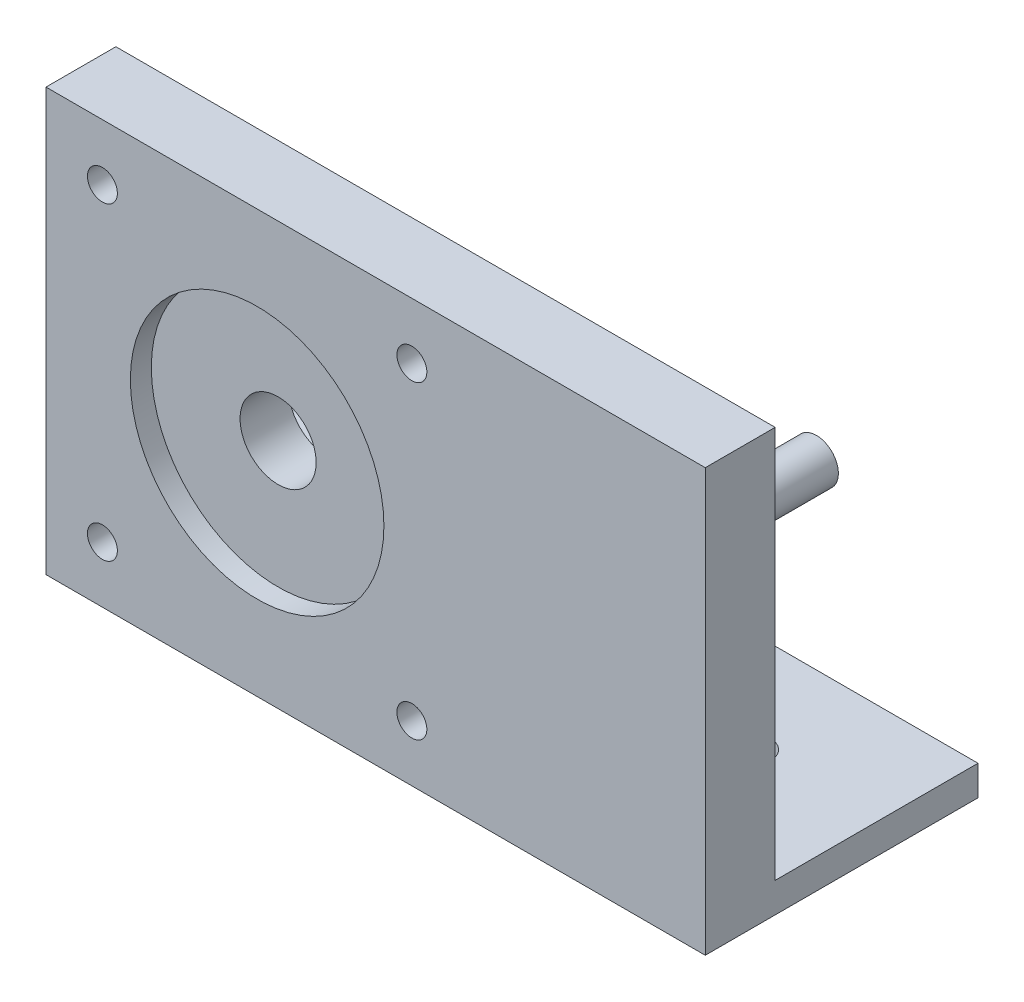
ISO-10303-21;
HEADER;
FILE_DESCRIPTION(('STEP AP214'),'2;1');
FILE_NAME('part.step','',(''),(''),'','','');
FILE_SCHEMA(('AUTOMOTIVE_DESIGN { 1 0 10303 214 1 1 1 1 }'));
ENDSEC;
DATA;
#1=APPLICATION_CONTEXT('core data for automotive mechanical design processes');
#2=APPLICATION_PROTOCOL_DEFINITION('international standard','automotive_design',2000,#1);
#3=PRODUCT_CONTEXT('',#1,'mechanical');
#4=PRODUCT('Part','Part','',(#3));
#5=PRODUCT_RELATED_PRODUCT_CATEGORY('part','',(#4));
#6=PRODUCT_DEFINITION_FORMATION('','',#4);
#7=PRODUCT_DEFINITION_CONTEXT('part definition',#1,'design');
#8=PRODUCT_DEFINITION('design','',#6,#7);
#9=PRODUCT_DEFINITION_SHAPE('','',#8);
#10=(LENGTH_UNIT() NAMED_UNIT(*) SI_UNIT(.MILLI.,.METRE.));
#11=(NAMED_UNIT(*) PLANE_ANGLE_UNIT() SI_UNIT($,.RADIAN.));
#12=(NAMED_UNIT(*) SI_UNIT($,.STERADIAN.) SOLID_ANGLE_UNIT());
#13=UNCERTAINTY_MEASURE_WITH_UNIT(LENGTH_MEASURE(1.E-05),#10,'distance_accuracy_value','');
#14=(GEOMETRIC_REPRESENTATION_CONTEXT(3) GLOBAL_UNCERTAINTY_ASSIGNED_CONTEXT((#13)) GLOBAL_UNIT_ASSIGNED_CONTEXT((#10,
#11,#12)) REPRESENTATION_CONTEXT('',''));
#15=CARTESIAN_POINT('',(0.,0.,0.));
#16=DIRECTION('',(0.,0.,1.));
#17=DIRECTION('',(1.,0.,0.));
#18=AXIS2_PLACEMENT_3D('',#15,#16,#17);
#19=CARTESIAN_POINT('',(5.65,36.65,0.));
#20=DIRECTION('',(0.,0.,-1.));
#21=DIRECTION('',(0.,1.,0.));
#22=AXIS2_PLACEMENT_3D('',#19,#20,#21);
#23=CYLINDRICAL_SURFACE('',#22,1.5);
#24=CARTESIAN_POINT('',(5.65,36.65,0.));
#25=DIRECTION('',(0.,0.,-1.));
#26=DIRECTION('',(0.,1.,0.));
#27=AXIS2_PLACEMENT_3D('',#24,#25,#26);
#28=CIRCLE('',#27,1.5);
#29=CARTESIAN_POINT('',(5.65,38.15,0.));
#30=VERTEX_POINT('',#29);
#31=EDGE_CURVE('E163',#30,#30,#28,.T.);
#32=ORIENTED_EDGE('',*,*,#31,.F.);
#33=EDGE_LOOP('',(#32));
#34=FACE_BOUND('',#33,.T.);
#35=CARTESIAN_POINT('',(5.65,36.65,-5.73));
#36=DIRECTION('',(0.,0.,-1.));
#37=DIRECTION('',(0.,1.,0.));
#38=AXIS2_PLACEMENT_3D('',#35,#36,#37);
#39=CIRCLE('',#38,1.5);
#40=CARTESIAN_POINT('',(5.65,38.15,-5.73));
#41=VERTEX_POINT('',#40);
#42=EDGE_CURVE('E40',#41,#41,#39,.F.);
#43=ORIENTED_EDGE('',*,*,#42,.F.);
#44=EDGE_LOOP('',(#43));
#45=FACE_BOUND('',#44,.T.);
#46=ADVANCED_FACE('F36',(#34,#45),#23,.F.);
#47=CARTESIAN_POINT('',(36.65,5.65,0.));
#48=DIRECTION('',(0.,0.,-1.));
#49=DIRECTION('',(0.,1.,0.));
#50=AXIS2_PLACEMENT_3D('',#47,#48,#49);
#51=CYLINDRICAL_SURFACE('',#50,1.5);
#52=CARTESIAN_POINT('',(36.65,5.65,0.));
#53=DIRECTION('',(0.,0.,-1.));
#54=DIRECTION('',(0.,1.,0.));
#55=AXIS2_PLACEMENT_3D('',#52,#53,#54);
#56=CIRCLE('',#55,1.5);
#57=CARTESIAN_POINT('',(36.65,7.15,0.));
#58=VERTEX_POINT('',#57);
#59=EDGE_CURVE('E201',#58,#58,#56,.T.);
#60=ORIENTED_EDGE('',*,*,#59,.F.);
#61=EDGE_LOOP('',(#60));
#62=FACE_BOUND('',#61,.T.);
#63=CARTESIAN_POINT('',(36.65,5.65,-5.73000000000001));
#64=DIRECTION('',(0.,0.,-1.));
#65=DIRECTION('',(0.,1.,0.));
#66=AXIS2_PLACEMENT_3D('',#63,#64,#65);
#67=CIRCLE('',#66,1.5);
#68=CARTESIAN_POINT('',(36.65,7.15,-5.73000000000001));
#69=VERTEX_POINT('',#68);
#70=EDGE_CURVE('E169',#69,#69,#67,.F.);
#71=ORIENTED_EDGE('',*,*,#70,.F.);
#72=EDGE_LOOP('',(#71));
#73=FACE_BOUND('',#72,.T.);
#74=ADVANCED_FACE('F345',(#62,#73),#51,.F.);
#75=CARTESIAN_POINT('',(36.65,36.65,0.));
#76=DIRECTION('',(0.,0.,-1.));
#77=DIRECTION('',(0.,1.,0.));
#78=AXIS2_PLACEMENT_3D('',#75,#76,#77);
#79=CYLINDRICAL_SURFACE('',#78,1.5);
#80=CARTESIAN_POINT('',(36.65,36.65,0.));
#81=DIRECTION('',(0.,0.,-1.));
#82=DIRECTION('',(0.,1.,0.));
#83=AXIS2_PLACEMENT_3D('',#80,#81,#82);
#84=CIRCLE('',#83,1.5);
#85=CARTESIAN_POINT('',(36.65,38.15,0.));
#86=VERTEX_POINT('',#85);
#87=EDGE_CURVE('E204',#86,#86,#84,.T.);
#88=ORIENTED_EDGE('',*,*,#87,.F.);
#89=EDGE_LOOP('',(#88));
#90=FACE_BOUND('',#89,.T.);
#91=CARTESIAN_POINT('',(36.65,36.65,-5.73));
#92=DIRECTION('',(0.,0.,-1.));
#93=DIRECTION('',(0.,1.,0.));
#94=AXIS2_PLACEMENT_3D('',#91,#92,#93);
#95=CIRCLE('',#94,1.5);
#96=CARTESIAN_POINT('',(36.65,38.15,-5.73));
#97=VERTEX_POINT('',#96);
#98=EDGE_CURVE('E167',#97,#97,#95,.F.);
#99=ORIENTED_EDGE('',*,*,#98,.F.);
#100=EDGE_LOOP('',(#99));
#101=FACE_BOUND('',#100,.T.);
#102=ADVANCED_FACE('F351',(#90,#101),#79,.F.);
#103=CARTESIAN_POINT('',(5.65000000000001,5.65,0.));
#104=DIRECTION('',(0.,0.,-1.));
#105=DIRECTION('',(0.,1.,0.));
#106=AXIS2_PLACEMENT_3D('',#103,#104,#105);
#107=CYLINDRICAL_SURFACE('',#106,1.5);
#108=CARTESIAN_POINT('',(5.65000000000001,5.65,0.));
#109=DIRECTION('',(0.,0.,-1.));
#110=DIRECTION('',(0.,1.,0.));
#111=AXIS2_PLACEMENT_3D('',#108,#109,#110);
#112=CIRCLE('',#111,1.5);
#113=CARTESIAN_POINT('',(5.65000000000001,7.15,0.));
#114=VERTEX_POINT('',#113);
#115=EDGE_CURVE('E207',#114,#114,#112,.T.);
#116=ORIENTED_EDGE('',*,*,#115,.F.);
#117=EDGE_LOOP('',(#116));
#118=FACE_BOUND('',#117,.T.);
#119=CARTESIAN_POINT('',(5.65000000000001,5.65,-5.73000000000001));
#120=DIRECTION('',(0.,0.,-1.));
#121=DIRECTION('',(0.,1.,0.));
#122=AXIS2_PLACEMENT_3D('',#119,#120,#121);
#123=CIRCLE('',#122,1.5);
#124=CARTESIAN_POINT('',(5.65000000000001,7.15,-5.73000000000001));
#125=VERTEX_POINT('',#124);
#126=EDGE_CURVE('E138',#125,#125,#123,.F.);
#127=ORIENTED_EDGE('',*,*,#126,.F.);
#128=EDGE_LOOP('',(#127));
#129=FACE_BOUND('',#128,.T.);
#130=ADVANCED_FACE('F383',(#118,#129),#107,.F.);
#131=CARTESIAN_POINT('',(66.04,0.,0.));
#132=DIRECTION('',(0.,0.,-1.));
#133=DIRECTION('',(-1.,0.,0.));
#134=AXIS2_PLACEMENT_3D('',#131,#132,#133);
#135=PLANE('',#134);
#136=ORIENTED_EDGE('',*,*,#115,.T.);
#137=EDGE_LOOP('',(#136));
#138=FACE_BOUND('',#137,.T.);
#139=ORIENTED_EDGE('',*,*,#87,.T.);
#140=EDGE_LOOP('',(#139));
#141=FACE_BOUND('',#140,.T.);
#142=ORIENTED_EDGE('',*,*,#59,.T.);
#143=EDGE_LOOP('',(#142));
#144=FACE_BOUND('',#143,.T.);
#145=ORIENTED_EDGE('',*,*,#31,.T.);
#146=EDGE_LOOP('',(#145));
#147=FACE_BOUND('',#146,.T.);
#148=CARTESIAN_POINT('',(21.15,21.15,0.));
#149=DIRECTION('',(0.,0.,1.));
#150=DIRECTION('',(1.,0.,0.));
#151=AXIS2_PLACEMENT_3D('',#148,#149,#150);
#152=CIRCLE('',#151,12.7);
#153=CARTESIAN_POINT('',(33.85,21.15,0.));
#154=VERTEX_POINT('',#153);
#155=EDGE_CURVE('E162',#154,#154,#152,.T.);
#156=ORIENTED_EDGE('',*,*,#155,.F.);
#157=EDGE_LOOP('',(#156));
#158=FACE_BOUND('',#157,.T.);
#159=DIRECTION('',(0.,-1.,0.));
#160=VECTOR('',#159,1.);
#161=CARTESIAN_POINT('',(0.,0.,0.));
#162=LINE('',#161,#160);
#163=CARTESIAN_POINT('',(0.,42.3,0.));
#164=VERTEX_POINT('',#163);
#165=CARTESIAN_POINT('',(0.,0.,0.));
#166=VERTEX_POINT('',#165);
#167=EDGE_CURVE('E217',#164,#166,#162,.T.);
#168=ORIENTED_EDGE('',*,*,#167,.T.);
#169=DIRECTION('',(-1.,0.,0.));
#170=VECTOR('',#169,1.);
#171=CARTESIAN_POINT('',(66.04,0.,0.));
#172=LINE('',#171,#170);
#173=CARTESIAN_POINT('',(66.04,0.,0.));
#174=VERTEX_POINT('',#173);
#175=EDGE_CURVE('E45',#174,#166,#172,.T.);
#176=ORIENTED_EDGE('',*,*,#175,.F.);
#177=DIRECTION('',(0.,-1.,0.));
#178=VECTOR('',#177,1.);
#179=CARTESIAN_POINT('',(66.04,0.,0.));
#180=LINE('',#179,#178);
#181=CARTESIAN_POINT('',(66.04,42.3,0.));
#182=VERTEX_POINT('',#181);
#183=EDGE_CURVE('E220',#182,#174,#180,.T.);
#184=ORIENTED_EDGE('',*,*,#183,.F.);
#185=DIRECTION('',(-1.,0.,0.));
#186=VECTOR('',#185,1.);
#187=CARTESIAN_POINT('',(66.04,42.3,0.));
#188=LINE('',#187,#186);
#189=EDGE_CURVE('E234',#182,#164,#188,.T.);
#190=ORIENTED_EDGE('',*,*,#189,.T.);
#191=EDGE_LOOP('',(#168,#176,#184,#190));
#192=FACE_BOUND('',#191,.T.);
#193=ADVANCED_FACE('F38',(#138,#141,#144,#147,#158,#192),#135,.F.);
#194=CARTESIAN_POINT('',(66.04,0.,-27.32));
#195=DIRECTION('',(0.,1.,0.));
#196=DIRECTION('',(0.,0.,1.));
#197=AXIS2_PLACEMENT_3D('',#194,#195,#196);
#198=PLANE('',#197);
#199=CARTESIAN_POINT('',(20.3542,0.,-17.16));
#200=DIRECTION('',(0.,1.,0.));
#201=DIRECTION('',(0.,0.,1.));
#202=AXIS2_PLACEMENT_3D('',#199,#200,#201);
#203=CIRCLE('',#202,1.925);
#204=CARTESIAN_POINT('',(20.3542,0.,-15.235));
#205=VERTEX_POINT('',#204);
#206=EDGE_CURVE('E295',#205,#205,#203,.T.);
#207=ORIENTED_EDGE('',*,*,#206,.T.);
#208=EDGE_LOOP('',(#207));
#209=FACE_BOUND('',#208,.T.);
#210=CARTESIAN_POINT('',(53.501,0.,-17.16));
#211=DIRECTION('',(0.,1.,0.));
#212=DIRECTION('',(0.,0.,1.));
#213=AXIS2_PLACEMENT_3D('',#210,#211,#212);
#214=CIRCLE('',#213,1.925);
#215=CARTESIAN_POINT('',(53.501,0.,-15.235));
#216=VERTEX_POINT('',#215);
#217=EDGE_CURVE('E308',#216,#216,#214,.T.);
#218=ORIENTED_EDGE('',*,*,#217,.T.);
#219=EDGE_LOOP('',(#218));
#220=FACE_BOUND('',#219,.T.);
#221=DIRECTION('',(-1.,0.,0.));
#222=VECTOR('',#221,1.);
#223=CARTESIAN_POINT('',(29.3542,0.,-19.));
#224=LINE('',#223,#222);
#225=CARTESIAN_POINT('',(41.501,0.,-19.));
#226=VERTEX_POINT('',#225);
#227=CARTESIAN_POINT('',(29.3542,0.,-19.));
#228=VERTEX_POINT('',#227);
#229=EDGE_CURVE('E184',#226,#228,#224,.T.);
#230=ORIENTED_EDGE('',*,*,#229,.T.);
#231=DIRECTION('',(0.,0.,1.));
#232=VECTOR('',#231,1.);
#233=CARTESIAN_POINT('',(29.3542,0.,-7.));
#234=LINE('',#233,#232);
#235=CARTESIAN_POINT('',(29.3542,0.,-7.));
#236=VERTEX_POINT('',#235);
#237=EDGE_CURVE('E189',#228,#236,#234,.T.);
#238=ORIENTED_EDGE('',*,*,#237,.T.);
#239=DIRECTION('',(1.,0.,0.));
#240=VECTOR('',#239,1.);
#241=CARTESIAN_POINT('',(29.3542,0.,-7.));
#242=LINE('',#241,#240);
#243=CARTESIAN_POINT('',(41.501,0.,-7.));
#244=VERTEX_POINT('',#243);
#245=EDGE_CURVE('E282',#236,#244,#242,.T.);
#246=ORIENTED_EDGE('',*,*,#245,.T.);
#247=DIRECTION('',(0.,0.,-1.));
#248=VECTOR('',#247,1.);
#249=CARTESIAN_POINT('',(41.501,0.,-7.));
#250=LINE('',#249,#248);
#251=EDGE_CURVE('E60',#244,#226,#250,.T.);
#252=ORIENTED_EDGE('',*,*,#251,.T.);
#253=EDGE_LOOP('',(#230,#238,#246,#252));
#254=FACE_BOUND('',#253,.T.);
#255=DIRECTION('',(0.,0.,-1.));
#256=VECTOR('',#255,1.);
#257=CARTESIAN_POINT('',(0.,0.,-27.32));
#258=LINE('',#257,#256);
#259=CARTESIAN_POINT('',(0.,0.,-27.32));
#260=VERTEX_POINT('',#259);
#261=EDGE_CURVE('E237',#166,#260,#258,.T.);
#262=ORIENTED_EDGE('',*,*,#261,.T.);
#263=DIRECTION('',(-1.,0.,0.));
#264=VECTOR('',#263,1.);
#265=CARTESIAN_POINT('',(66.04,0.,-27.32));
#266=LINE('',#265,#264);
#267=CARTESIAN_POINT('',(66.04,0.,-27.32));
#268=VERTEX_POINT('',#267);
#269=EDGE_CURVE('E155',#268,#260,#266,.T.);
#270=ORIENTED_EDGE('',*,*,#269,.F.);
#271=DIRECTION('',(0.,0.,-1.));
#272=VECTOR('',#271,1.);
#273=CARTESIAN_POINT('',(66.04,0.,0.));
#274=LINE('',#273,#272);
#275=EDGE_CURVE('E223',#174,#268,#274,.T.);
#276=ORIENTED_EDGE('',*,*,#275,.F.);
#277=ORIENTED_EDGE('',*,*,#175,.T.);
#278=EDGE_LOOP('',(#262,#270,#276,#277));
#279=FACE_BOUND('',#278,.T.);
#280=ADVANCED_FACE('F264',(#209,#220,#254,#279),#198,.F.);
#281=CARTESIAN_POINT('',(66.04,3.,-27.32));
#282=DIRECTION('',(0.,0.,1.));
#283=DIRECTION('',(1.,0.,0.));
#284=AXIS2_PLACEMENT_3D('',#281,#282,#283);
#285=PLANE('',#284);
#286=DIRECTION('',(0.,1.,0.));
#287=VECTOR('',#286,1.);
#288=CARTESIAN_POINT('',(0.,3.,-27.32));
#289=LINE('',#288,#287);
#290=CARTESIAN_POINT('',(0.,3.,-27.32));
#291=VERTEX_POINT('',#290);
#292=EDGE_CURVE('E239',#260,#291,#289,.T.);
#293=ORIENTED_EDGE('',*,*,#292,.T.);
#294=DIRECTION('',(-1.,0.,0.));
#295=VECTOR('',#294,1.);
#296=CARTESIAN_POINT('',(66.04,3.,-27.32));
#297=LINE('',#296,#295);
#298=CARTESIAN_POINT('',(66.04,3.,-27.32));
#299=VERTEX_POINT('',#298);
#300=EDGE_CURVE('E148',#299,#291,#297,.T.);
#301=ORIENTED_EDGE('',*,*,#300,.F.);
#302=DIRECTION('',(0.,1.,0.));
#303=VECTOR('',#302,1.);
#304=CARTESIAN_POINT('',(66.04,3.,-27.32));
#305=LINE('',#304,#303);
#306=EDGE_CURVE('E226',#268,#299,#305,.T.);
#307=ORIENTED_EDGE('',*,*,#306,.F.);
#308=ORIENTED_EDGE('',*,*,#269,.T.);
#309=EDGE_LOOP('',(#293,#301,#307,#308));
#310=FACE_BOUND('',#309,.T.);
#311=ADVANCED_FACE('F328',(#310),#285,.F.);
#312=CARTESIAN_POINT('',(66.04,3.,-7.00000000000001));
#313=DIRECTION('',(0.,-1.,0.));
#314=DIRECTION('',(0.,0.,-1.));
#315=AXIS2_PLACEMENT_3D('',#312,#313,#314);
#316=PLANE('',#315);
#317=CARTESIAN_POINT('',(20.3542,3.,-17.16));
#318=DIRECTION('',(0.,1.,0.));
#319=DIRECTION('',(0.,0.,1.));
#320=AXIS2_PLACEMENT_3D('',#317,#318,#319);
#321=CIRCLE('',#320,1.925);
#322=CARTESIAN_POINT('',(20.3542,3.,-15.235));
#323=VERTEX_POINT('',#322);
#324=EDGE_CURVE('E311',#323,#323,#321,.T.);
#325=ORIENTED_EDGE('',*,*,#324,.F.);
#326=EDGE_LOOP('',(#325));
#327=FACE_BOUND('',#326,.T.);
#328=CARTESIAN_POINT('',(53.501,3.,-17.16));
#329=DIRECTION('',(0.,1.,0.));
#330=DIRECTION('',(0.,0.,1.));
#331=AXIS2_PLACEMENT_3D('',#328,#329,#330);
#332=CIRCLE('',#331,1.925);
#333=CARTESIAN_POINT('',(53.501,3.,-15.235));
#334=VERTEX_POINT('',#333);
#335=EDGE_CURVE('E305',#334,#334,#332,.T.);
#336=ORIENTED_EDGE('',*,*,#335,.F.);
#337=EDGE_LOOP('',(#336));
#338=FACE_BOUND('',#337,.T.);
#339=DIRECTION('',(-1.,0.,0.));
#340=VECTOR('',#339,1.);
#341=CARTESIAN_POINT('',(66.04,3.,-7.00000000000001));
#342=LINE('',#341,#340);
#343=CARTESIAN_POINT('',(29.3542,3.,-7.00000000000001));
#344=VERTEX_POINT('',#343);
#345=CARTESIAN_POINT('',(6.55415706600126,3.,-7.00000000000001));
#346=VERTEX_POINT('',#345);
#347=EDGE_CURVE('E135',#344,#346,#342,.T.);
#348=ORIENTED_EDGE('',*,*,#347,.F.);
#349=DIRECTION('',(0.,0.,1.));
#350=VECTOR('',#349,1.);
#351=CARTESIAN_POINT('',(29.3542,3.,-7.));
#352=LINE('',#351,#350);
#353=CARTESIAN_POINT('',(29.3542,3.,-19.));
#354=VERTEX_POINT('',#353);
#355=EDGE_CURVE('E174',#354,#344,#352,.T.);
#356=ORIENTED_EDGE('',*,*,#355,.F.);
#357=DIRECTION('',(-1.,0.,0.));
#358=VECTOR('',#357,1.);
#359=CARTESIAN_POINT('',(29.3542,3.,-19.));
#360=LINE('',#359,#358);
#361=CARTESIAN_POINT('',(41.501,3.,-19.));
#362=VERTEX_POINT('',#361);
#363=EDGE_CURVE('E181',#362,#354,#360,.T.);
#364=ORIENTED_EDGE('',*,*,#363,.F.);
#365=DIRECTION('',(0.,0.,-1.));
#366=VECTOR('',#365,1.);
#367=CARTESIAN_POINT('',(41.501,3.,-7.));
#368=LINE('',#367,#366);
#369=CARTESIAN_POINT('',(41.501,3.,-7.));
#370=VERTEX_POINT('',#369);
#371=EDGE_CURVE('E177',#370,#362,#368,.T.);
#372=ORIENTED_EDGE('',*,*,#371,.F.);
#373=CARTESIAN_POINT('',(66.04,3.,-7.00000000000001));
#374=VERTEX_POINT('',#373);
#375=EDGE_CURVE('E145',#374,#370,#342,.T.);
#376=ORIENTED_EDGE('',*,*,#375,.F.);
#377=DIRECTION('',(0.,0.,1.));
#378=VECTOR('',#377,1.);
#379=CARTESIAN_POINT('',(66.04,3.,-7.00000000000001));
#380=LINE('',#379,#378);
#381=EDGE_CURVE('E228',#299,#374,#380,.T.);
#382=ORIENTED_EDGE('',*,*,#381,.F.);
#383=ORIENTED_EDGE('',*,*,#300,.T.);
#384=DIRECTION('',(0.,0.,1.));
#385=VECTOR('',#384,1.);
#386=CARTESIAN_POINT('',(0.,3.,-7.00000000000001));
#387=LINE('',#386,#385);
#388=CARTESIAN_POINT('',(0.,3.,-7.00000000000001));
#389=VERTEX_POINT('',#388);
#390=EDGE_CURVE('E241',#291,#389,#387,.T.);
#391=ORIENTED_EDGE('',*,*,#390,.T.);
#392=CARTESIAN_POINT('',(4.74584293399875,3.,-7.00000000000001));
#393=VERTEX_POINT('',#392);
#394=EDGE_CURVE('E137',#393,#389,#342,.T.);
#395=ORIENTED_EDGE('',*,*,#394,.F.);
#396=DIRECTION('',(1.,0.,0.));
#397=VECTOR('',#396,1.);
#398=CARTESIAN_POINT('',(66.04,3.,-7.00000000000001));
#399=LINE('',#398,#397);
#400=EDGE_CURVE('E129',#393,#346,#399,.T.);
#401=ORIENTED_EDGE('',*,*,#400,.T.);
#402=EDGE_LOOP('',(#348,#356,#364,#372,#376,#382,#383,#391,#395,#401));
#403=FACE_BOUND('',#402,.T.);
#404=ADVANCED_FACE('F133',(#327,#338,#403),#316,.F.);
#405=CARTESIAN_POINT('',(66.04,42.3,-7.));
#406=DIRECTION('',(0.,0.,1.));
#407=DIRECTION('',(0.,-1.,0.));
#408=AXIS2_PLACEMENT_3D('',#405,#406,#407);
#409=PLANE('',#408);
#410=CARTESIAN_POINT('',(5.65,36.65,-7.));
#411=DIRECTION('',(0.,0.,-1.));
#412=DIRECTION('',(0.,1.,0.));
#413=AXIS2_PLACEMENT_3D('',#410,#411,#412);
#414=CIRCLE('',#413,2.8);
#415=CARTESIAN_POINT('',(5.65,39.45,-7.));
#416=VERTEX_POINT('',#415);
#417=EDGE_CURVE('E292',#416,#416,#414,.T.);
#418=ORIENTED_EDGE('',*,*,#417,.F.);
#419=EDGE_LOOP('',(#418));
#420=FACE_BOUND('',#419,.T.);
#421=CARTESIAN_POINT('',(36.65,5.65,-7.00000000000001));
#422=DIRECTION('',(0.,0.,-1.));
#423=DIRECTION('',(0.,1.,0.));
#424=AXIS2_PLACEMENT_3D('',#421,#422,#423);
#425=CIRCLE('',#424,2.8);
#426=CARTESIAN_POINT('',(36.65,8.45,-7.00000000000001));
#427=VERTEX_POINT('',#426);
#428=EDGE_CURVE('E300',#427,#427,#425,.T.);
#429=ORIENTED_EDGE('',*,*,#428,.F.);
#430=EDGE_LOOP('',(#429));
#431=FACE_BOUND('',#430,.T.);
#432=CARTESIAN_POINT('',(36.65,36.65,-7.));
#433=DIRECTION('',(0.,0.,-1.));
#434=DIRECTION('',(0.,1.,0.));
#435=AXIS2_PLACEMENT_3D('',#432,#433,#434);
#436=CIRCLE('',#435,2.8);
#437=CARTESIAN_POINT('',(36.65,39.45,-7.));
#438=VERTEX_POINT('',#437);
#439=EDGE_CURVE('E286',#438,#438,#436,.T.);
#440=ORIENTED_EDGE('',*,*,#439,.F.);
#441=EDGE_LOOP('',(#440));
#442=FACE_BOUND('',#441,.T.);
#443=CARTESIAN_POINT('',(49.852,21.15,-7.));
#444=DIRECTION('',(0.,0.,1.));
#445=DIRECTION('',(0.,-1.,0.));
#446=AXIS2_PLACEMENT_3D('',#443,#444,#445);
#447=CIRCLE('',#446,2.2);
#448=CARTESIAN_POINT('',(49.852,18.95,-7.));
#449=VERTEX_POINT('',#448);
#450=EDGE_CURVE('E11',#449,#449,#447,.F.);
#451=ORIENTED_EDGE('',*,*,#450,.F.);
#452=EDGE_LOOP('',(#451));
#453=FACE_BOUND('',#452,.T.);
#454=CARTESIAN_POINT('',(21.15,21.15,-7.));
#455=DIRECTION('',(0.,0.,-1.));
#456=DIRECTION('',(0.,1.,0.));
#457=AXIS2_PLACEMENT_3D('',#454,#455,#456);
#458=CIRCLE('',#457,3.81);
#459=CARTESIAN_POINT('',(21.15,24.96,-7.));
#460=VERTEX_POINT('',#459);
#461=EDGE_CURVE('E200',#460,#460,#458,.T.);
#462=ORIENTED_EDGE('',*,*,#461,.F.);
#463=EDGE_LOOP('',(#462));
#464=FACE_BOUND('',#463,.T.);
#465=ORIENTED_EDGE('',*,*,#347,.T.);
#466=CARTESIAN_POINT('',(5.65000000000001,5.65,-7.00000000000001));
#467=DIRECTION('',(0.,0.,-1.));
#468=DIRECTION('',(0.,1.,0.));
#469=AXIS2_PLACEMENT_3D('',#466,#467,#468);
#470=CIRCLE('',#469,2.8);
#471=EDGE_CURVE('E119',#393,#346,#470,.T.);
#472=ORIENTED_EDGE('',*,*,#471,.F.);
#473=ORIENTED_EDGE('',*,*,#394,.T.);
#474=DIRECTION('',(0.,1.,0.));
#475=VECTOR('',#474,1.);
#476=CARTESIAN_POINT('',(0.,42.3,-7.));
#477=LINE('',#476,#475);
#478=CARTESIAN_POINT('',(0.,42.3,-7.));
#479=VERTEX_POINT('',#478);
#480=EDGE_CURVE('E243',#389,#479,#477,.T.);
#481=ORIENTED_EDGE('',*,*,#480,.T.);
#482=DIRECTION('',(-1.,0.,0.));
#483=VECTOR('',#482,1.);
#484=CARTESIAN_POINT('',(66.04,42.3,-7.));
#485=LINE('',#484,#483);
#486=CARTESIAN_POINT('',(66.04,42.3,-7.));
#487=VERTEX_POINT('',#486);
#488=EDGE_CURVE('E149',#487,#479,#485,.T.);
#489=ORIENTED_EDGE('',*,*,#488,.F.);
#490=DIRECTION('',(0.,1.,0.));
#491=VECTOR('',#490,1.);
#492=CARTESIAN_POINT('',(66.04,42.3,-7.));
#493=LINE('',#492,#491);
#494=EDGE_CURVE('E230',#374,#487,#493,.T.);
#495=ORIENTED_EDGE('',*,*,#494,.F.);
#496=ORIENTED_EDGE('',*,*,#375,.T.);
#497=DIRECTION('',(0.,1.,0.));
#498=VECTOR('',#497,1.);
#499=CARTESIAN_POINT('',(41.501,0.,-7.));
#500=LINE('',#499,#498);
#501=EDGE_CURVE('E195',#244,#370,#500,.T.);
#502=ORIENTED_EDGE('',*,*,#501,.F.);
#503=ORIENTED_EDGE('',*,*,#245,.F.);
#504=DIRECTION('',(0.,1.,0.));
#505=VECTOR('',#504,1.);
#506=CARTESIAN_POINT('',(29.3542,0.,-7.));
#507=LINE('',#506,#505);
#508=EDGE_CURVE('E144',#236,#344,#507,.T.);
#509=ORIENTED_EDGE('',*,*,#508,.T.);
#510=EDGE_LOOP('',(#465,#472,#473,#481,#489,#495,#496,#502,#503,#509));
#511=FACE_BOUND('',#510,.T.);
#512=ADVANCED_FACE('F142',(#420,#431,#442,#453,#464,#511),#409,.F.);
#513=CARTESIAN_POINT('',(66.04,42.3,0.));
#514=DIRECTION('',(0.,-1.,0.));
#515=DIRECTION('',(0.,0.,-1.));
#516=AXIS2_PLACEMENT_3D('',#513,#514,#515);
#517=PLANE('',#516);
#518=DIRECTION('',(0.,0.,1.));
#519=VECTOR('',#518,1.);
#520=CARTESIAN_POINT('',(0.,42.3,0.));
#521=LINE('',#520,#519);
#522=EDGE_CURVE('E224',#479,#164,#521,.T.);
#523=ORIENTED_EDGE('',*,*,#522,.T.);
#524=ORIENTED_EDGE('',*,*,#189,.F.);
#525=DIRECTION('',(0.,0.,1.));
#526=VECTOR('',#525,1.);
#527=CARTESIAN_POINT('',(66.04,42.3,0.));
#528=LINE('',#527,#526);
#529=EDGE_CURVE('E232',#487,#182,#528,.T.);
#530=ORIENTED_EDGE('',*,*,#529,.F.);
#531=ORIENTED_EDGE('',*,*,#488,.T.);
#532=EDGE_LOOP('',(#523,#524,#530,#531));
#533=FACE_BOUND('',#532,.T.);
#534=ADVANCED_FACE('F255',(#533),#517,.F.);
#535=CARTESIAN_POINT('',(66.04,0.,0.));
#536=DIRECTION('',(-1.,0.,0.));
#537=DIRECTION('',(0.,0.,1.));
#538=AXIS2_PLACEMENT_3D('',#535,#536,#537);
#539=PLANE('',#538);
#540=ORIENTED_EDGE('',*,*,#183,.T.);
#541=ORIENTED_EDGE('',*,*,#275,.T.);
#542=ORIENTED_EDGE('',*,*,#306,.T.);
#543=ORIENTED_EDGE('',*,*,#381,.T.);
#544=ORIENTED_EDGE('',*,*,#494,.T.);
#545=ORIENTED_EDGE('',*,*,#529,.T.);
#546=EDGE_LOOP('',(#540,#541,#542,#543,#544,#545));
#547=FACE_BOUND('',#546,.T.);
#548=ADVANCED_FACE('F268',(#547),#539,.F.);
#549=CARTESIAN_POINT('',(0.,0.,0.));
#550=DIRECTION('',(-1.,0.,0.));
#551=DIRECTION('',(0.,0.,1.));
#552=AXIS2_PLACEMENT_3D('',#549,#550,#551);
#553=PLANE('',#552);
#554=ORIENTED_EDGE('',*,*,#167,.F.);
#555=ORIENTED_EDGE('',*,*,#522,.F.);
#556=ORIENTED_EDGE('',*,*,#480,.F.);
#557=ORIENTED_EDGE('',*,*,#390,.F.);
#558=ORIENTED_EDGE('',*,*,#292,.F.);
#559=ORIENTED_EDGE('',*,*,#261,.F.);
#560=EDGE_LOOP('',(#554,#555,#556,#557,#558,#559));
#561=FACE_BOUND('',#560,.T.);
#562=ADVANCED_FACE('F259',(#561),#553,.T.);
#563=CARTESIAN_POINT('',(21.15,21.15,-2.1));
#564=DIRECTION('',(0.,0.,1.));
#565=DIRECTION('',(1.,0.,0.));
#566=AXIS2_PLACEMENT_3D('',#563,#564,#565);
#567=CYLINDRICAL_SURFACE('',#566,12.7);
#568=CARTESIAN_POINT('',(21.15,21.15,-2.1));
#569=DIRECTION('',(0.,0.,1.));
#570=DIRECTION('',(1.,0.,0.));
#571=AXIS2_PLACEMENT_3D('',#568,#569,#570);
#572=CIRCLE('',#571,12.7);
#573=CARTESIAN_POINT('',(33.85,21.15,-2.1));
#574=VERTEX_POINT('',#573);
#575=EDGE_CURVE('E214',#574,#574,#572,.T.);
#576=ORIENTED_EDGE('',*,*,#575,.F.);
#577=EDGE_LOOP('',(#576));
#578=FACE_BOUND('',#577,.T.);
#579=ORIENTED_EDGE('',*,*,#155,.T.);
#580=EDGE_LOOP('',(#579));
#581=FACE_BOUND('',#580,.T.);
#582=ADVANCED_FACE('F363',(#578,#581),#567,.F.);
#583=CARTESIAN_POINT('',(21.15,21.15,-2.1));
#584=DIRECTION('',(0.,0.,1.));
#585=DIRECTION('',(1.,0.,0.));
#586=AXIS2_PLACEMENT_3D('',#583,#584,#585);
#587=PLANE('',#586);
#588=CARTESIAN_POINT('',(21.15,21.15,-2.1));
#589=DIRECTION('',(0.,0.,1.));
#590=DIRECTION('',(1.,0.,0.));
#591=AXIS2_PLACEMENT_3D('',#588,#589,#590);
#592=CIRCLE('',#591,3.81);
#593=CARTESIAN_POINT('',(24.96,21.15,-2.1));
#594=VERTEX_POINT('',#593);
#595=EDGE_CURVE('E160',#594,#594,#592,.T.);
#596=ORIENTED_EDGE('',*,*,#595,.F.);
#597=EDGE_LOOP('',(#596));
#598=FACE_BOUND('',#597,.T.);
#599=ORIENTED_EDGE('',*,*,#575,.T.);
#600=EDGE_LOOP('',(#599));
#601=FACE_BOUND('',#600,.T.);
#602=ADVANCED_FACE('F359',(#598,#601),#587,.T.);
#603=CARTESIAN_POINT('',(21.15,21.15,0.));
#604=DIRECTION('',(0.,0.,-1.));
#605=DIRECTION('',(0.,1.,0.));
#606=AXIS2_PLACEMENT_3D('',#603,#604,#605);
#607=CYLINDRICAL_SURFACE('',#606,3.81);
#608=ORIENTED_EDGE('',*,*,#595,.T.);
#609=EDGE_LOOP('',(#608));
#610=FACE_BOUND('',#609,.T.);
#611=ORIENTED_EDGE('',*,*,#461,.T.);
#612=EDGE_LOOP('',(#611));
#613=FACE_BOUND('',#612,.T.);
#614=ADVANCED_FACE('F362',(#610,#613),#607,.F.);
#615=CARTESIAN_POINT('',(49.852,21.15,-27.32));
#616=DIRECTION('',(0.,0.,1.));
#617=DIRECTION('',(0.,-1.,0.));
#618=AXIS2_PLACEMENT_3D('',#615,#616,#617);
#619=CYLINDRICAL_SURFACE('',#618,2.2);
#620=CARTESIAN_POINT('',(49.852,21.15,-27.32));
#621=DIRECTION('',(0.,0.,-1.));
#622=DIRECTION('',(0.,1.,0.));
#623=AXIS2_PLACEMENT_3D('',#620,#621,#622);
#624=CIRCLE('',#623,2.2);
#625=CARTESIAN_POINT('',(49.852,23.35,-27.32));
#626=VERTEX_POINT('',#625);
#627=EDGE_CURVE('E192',#626,#626,#624,.T.);
#628=ORIENTED_EDGE('',*,*,#627,.F.);
#629=EDGE_LOOP('',(#628));
#630=FACE_BOUND('',#629,.T.);
#631=ORIENTED_EDGE('',*,*,#450,.T.);
#632=EDGE_LOOP('',(#631));
#633=FACE_BOUND('',#632,.T.);
#634=ADVANCED_FACE('F431',(#630,#633),#619,.T.);
#635=CARTESIAN_POINT('',(49.852,21.15,-27.32));
#636=DIRECTION('',(0.,0.,-1.));
#637=DIRECTION('',(0.,1.,0.));
#638=AXIS2_PLACEMENT_3D('',#635,#636,#637);
#639=PLANE('',#638);
#640=ORIENTED_EDGE('',*,*,#627,.T.);
#641=EDGE_LOOP('',(#640));
#642=FACE_BOUND('',#641,.T.);
#643=ADVANCED_FACE('F428',(#642),#639,.T.);
#644=CARTESIAN_POINT('',(29.3542,0.,-7.));
#645=DIRECTION('',(-1.,0.,0.));
#646=DIRECTION('',(0.,0.,1.));
#647=AXIS2_PLACEMENT_3D('',#644,#645,#646);
#648=PLANE('',#647);
#649=ORIENTED_EDGE('',*,*,#355,.T.);
#650=ORIENTED_EDGE('',*,*,#508,.F.);
#651=ORIENTED_EDGE('',*,*,#237,.F.);
#652=DIRECTION('',(0.,1.,0.));
#653=VECTOR('',#652,1.);
#654=CARTESIAN_POINT('',(29.3542,0.,-19.));
#655=LINE('',#654,#653);
#656=EDGE_CURVE('E190',#228,#354,#655,.T.);
#657=ORIENTED_EDGE('',*,*,#656,.T.);
#658=EDGE_LOOP('',(#649,#650,#651,#657));
#659=FACE_BOUND('',#658,.T.);
#660=ADVANCED_FACE('F422',(#659),#648,.F.);
#661=CARTESIAN_POINT('',(29.3542,0.,-19.));
#662=DIRECTION('',(0.,0.,-1.));
#663=DIRECTION('',(-1.,0.,0.));
#664=AXIS2_PLACEMENT_3D('',#661,#662,#663);
#665=PLANE('',#664);
#666=ORIENTED_EDGE('',*,*,#363,.T.);
#667=ORIENTED_EDGE('',*,*,#656,.F.);
#668=ORIENTED_EDGE('',*,*,#229,.F.);
#669=DIRECTION('',(0.,1.,0.));
#670=VECTOR('',#669,1.);
#671=CARTESIAN_POINT('',(41.501,0.,-19.));
#672=LINE('',#671,#670);
#673=EDGE_CURVE('E193',#226,#362,#672,.T.);
#674=ORIENTED_EDGE('',*,*,#673,.T.);
#675=EDGE_LOOP('',(#666,#667,#668,#674));
#676=FACE_BOUND('',#675,.T.);
#677=ADVANCED_FACE('F278',(#676),#665,.F.);
#678=CARTESIAN_POINT('',(41.501,0.,-7.));
#679=DIRECTION('',(1.,0.,0.));
#680=DIRECTION('',(0.,0.,-1.));
#681=AXIS2_PLACEMENT_3D('',#678,#679,#680);
#682=PLANE('',#681);
#683=ORIENTED_EDGE('',*,*,#371,.T.);
#684=ORIENTED_EDGE('',*,*,#673,.F.);
#685=ORIENTED_EDGE('',*,*,#251,.F.);
#686=ORIENTED_EDGE('',*,*,#501,.T.);
#687=EDGE_LOOP('',(#683,#684,#685,#686));
#688=FACE_BOUND('',#687,.T.);
#689=ADVANCED_FACE('F274',(#688),#682,.F.);
#690=CARTESIAN_POINT('',(5.65000000000001,5.65,-5.73000000000001));
#691=DIRECTION('',(0.,0.,-1.));
#692=DIRECTION('',(0.,1.,0.));
#693=AXIS2_PLACEMENT_3D('',#690,#691,#692);
#694=PLANE('',#693);
#695=CARTESIAN_POINT('',(5.65000000000001,5.65,-5.73000000000001));
#696=DIRECTION('',(0.,0.,-1.));
#697=DIRECTION('',(0.,1.,0.));
#698=AXIS2_PLACEMENT_3D('',#695,#696,#697);
#699=CIRCLE('',#698,2.8);
#700=CARTESIAN_POINT('',(5.65000000000001,8.45,-5.73000000000001));
#701=VERTEX_POINT('',#700);
#702=EDGE_CURVE('E130',#701,#701,#699,.T.);
#703=ORIENTED_EDGE('',*,*,#702,.T.);
#704=EDGE_LOOP('',(#703));
#705=FACE_BOUND('',#704,.T.);
#706=ORIENTED_EDGE('',*,*,#126,.T.);
#707=EDGE_LOOP('',(#706));
#708=FACE_BOUND('',#707,.T.);
#709=ADVANCED_FACE('F425',(#705,#708),#694,.T.);
#710=CARTESIAN_POINT('',(5.65000000000001,5.65,-7.00000000000001));
#711=DIRECTION('',(0.,0.,-1.));
#712=DIRECTION('',(0.,1.,0.));
#713=AXIS2_PLACEMENT_3D('',#710,#711,#712);
#714=PLANE('',#713);
#715=EDGE_CURVE('E52',#346,#393,#470,.T.);
#716=ORIENTED_EDGE('',*,*,#715,.F.);
#717=ORIENTED_EDGE('',*,*,#400,.F.);
#718=EDGE_LOOP('',(#716,#717));
#719=FACE_BOUND('',#718,.T.);
#720=ADVANCED_FACE('F128',(#719),#714,.F.);
#721=CARTESIAN_POINT('',(5.65000000000001,5.65,-5.73000000000001));
#722=DIRECTION('',(0.,0.,-1.));
#723=DIRECTION('',(0.,1.,0.));
#724=AXIS2_PLACEMENT_3D('',#721,#722,#723);
#725=CYLINDRICAL_SURFACE('',#724,2.8);
#726=ORIENTED_EDGE('',*,*,#702,.F.);
#727=EDGE_LOOP('',(#726));
#728=FACE_BOUND('',#727,.T.);
#729=ORIENTED_EDGE('',*,*,#715,.T.);
#730=ORIENTED_EDGE('',*,*,#471,.T.);
#731=EDGE_LOOP('',(#729,#730));
#732=FACE_BOUND('',#731,.T.);
#733=ADVANCED_FACE('F120',(#728,#732),#725,.F.);
#734=CARTESIAN_POINT('',(36.65,36.65,-5.73));
#735=DIRECTION('',(0.,0.,-1.));
#736=DIRECTION('',(0.,1.,0.));
#737=AXIS2_PLACEMENT_3D('',#734,#735,#736);
#738=PLANE('',#737);
#739=CARTESIAN_POINT('',(36.65,36.65,-5.73));
#740=DIRECTION('',(0.,0.,-1.));
#741=DIRECTION('',(0.,1.,0.));
#742=AXIS2_PLACEMENT_3D('',#739,#740,#741);
#743=CIRCLE('',#742,2.8);
#744=CARTESIAN_POINT('',(36.65,39.45,-5.73));
#745=VERTEX_POINT('',#744);
#746=EDGE_CURVE('E139',#745,#745,#743,.T.);
#747=ORIENTED_EDGE('',*,*,#746,.T.);
#748=EDGE_LOOP('',(#747));
#749=FACE_BOUND('',#748,.T.);
#750=ORIENTED_EDGE('',*,*,#98,.T.);
#751=EDGE_LOOP('',(#750));
#752=FACE_BOUND('',#751,.T.);
#753=ADVANCED_FACE('F404',(#749,#752),#738,.T.);
#754=CARTESIAN_POINT('',(36.65,36.65,-5.73));
#755=DIRECTION('',(0.,0.,-1.));
#756=DIRECTION('',(0.,1.,0.));
#757=AXIS2_PLACEMENT_3D('',#754,#755,#756);
#758=CYLINDRICAL_SURFACE('',#757,2.8);
#759=ORIENTED_EDGE('',*,*,#746,.F.);
#760=EDGE_LOOP('',(#759));
#761=FACE_BOUND('',#760,.T.);
#762=ORIENTED_EDGE('',*,*,#439,.T.);
#763=EDGE_LOOP('',(#762));
#764=FACE_BOUND('',#763,.T.);
#765=ADVANCED_FACE('F406',(#761,#764),#758,.F.);
#766=CARTESIAN_POINT('',(36.65,5.65,-5.73000000000001));
#767=DIRECTION('',(0.,0.,-1.));
#768=DIRECTION('',(0.,1.,0.));
#769=AXIS2_PLACEMENT_3D('',#766,#767,#768);
#770=PLANE('',#769);
#771=CARTESIAN_POINT('',(36.65,5.65,-5.73000000000001));
#772=DIRECTION('',(0.,0.,-1.));
#773=DIRECTION('',(0.,1.,0.));
#774=AXIS2_PLACEMENT_3D('',#771,#772,#773);
#775=CIRCLE('',#774,2.8);
#776=CARTESIAN_POINT('',(36.65,8.45,-5.73000000000001));
#777=VERTEX_POINT('',#776);
#778=EDGE_CURVE('E289',#777,#777,#775,.T.);
#779=ORIENTED_EDGE('',*,*,#778,.T.);
#780=EDGE_LOOP('',(#779));
#781=FACE_BOUND('',#780,.T.);
#782=ORIENTED_EDGE('',*,*,#70,.T.);
#783=EDGE_LOOP('',(#782));
#784=FACE_BOUND('',#783,.T.);
#785=ADVANCED_FACE('F413',(#781,#784),#770,.T.);
#786=CARTESIAN_POINT('',(36.65,5.65,-5.73000000000001));
#787=DIRECTION('',(0.,0.,-1.));
#788=DIRECTION('',(0.,1.,0.));
#789=AXIS2_PLACEMENT_3D('',#786,#787,#788);
#790=CYLINDRICAL_SURFACE('',#789,2.8);
#791=ORIENTED_EDGE('',*,*,#778,.F.);
#792=EDGE_LOOP('',(#791));
#793=FACE_BOUND('',#792,.T.);
#794=ORIENTED_EDGE('',*,*,#428,.T.);
#795=EDGE_LOOP('',(#794));
#796=FACE_BOUND('',#795,.T.);
#797=ADVANCED_FACE('F505',(#793,#796),#790,.F.);
#798=CARTESIAN_POINT('',(5.65,36.65,-5.73));
#799=DIRECTION('',(0.,0.,-1.));
#800=DIRECTION('',(0.,1.,0.));
#801=AXIS2_PLACEMENT_3D('',#798,#799,#800);
#802=PLANE('',#801);
#803=CARTESIAN_POINT('',(5.65,36.65,-5.73));
#804=DIRECTION('',(0.,0.,-1.));
#805=DIRECTION('',(0.,1.,0.));
#806=AXIS2_PLACEMENT_3D('',#803,#804,#805);
#807=CIRCLE('',#806,2.8);
#808=CARTESIAN_POINT('',(5.65,39.45,-5.73));
#809=VERTEX_POINT('',#808);
#810=EDGE_CURVE('E124',#809,#809,#807,.T.);
#811=ORIENTED_EDGE('',*,*,#810,.T.);
#812=EDGE_LOOP('',(#811));
#813=FACE_BOUND('',#812,.T.);
#814=ORIENTED_EDGE('',*,*,#42,.T.);
#815=EDGE_LOOP('',(#814));
#816=FACE_BOUND('',#815,.T.);
#817=ADVANCED_FACE('F339',(#813,#816),#802,.T.);
#818=CARTESIAN_POINT('',(5.65,36.65,-5.73));
#819=DIRECTION('',(0.,0.,-1.));
#820=DIRECTION('',(0.,1.,0.));
#821=AXIS2_PLACEMENT_3D('',#818,#819,#820);
#822=CYLINDRICAL_SURFACE('',#821,2.8);
#823=ORIENTED_EDGE('',*,*,#810,.F.);
#824=EDGE_LOOP('',(#823));
#825=FACE_BOUND('',#824,.T.);
#826=ORIENTED_EDGE('',*,*,#417,.T.);
#827=EDGE_LOOP('',(#826));
#828=FACE_BOUND('',#827,.T.);
#829=ADVANCED_FACE('F333',(#825,#828),#822,.F.);
#830=CARTESIAN_POINT('',(53.501,0.,-17.16));
#831=DIRECTION('',(0.,1.,0.));
#832=DIRECTION('',(0.,0.,1.));
#833=AXIS2_PLACEMENT_3D('',#830,#831,#832);
#834=CYLINDRICAL_SURFACE('',#833,1.925);
#835=ORIENTED_EDGE('',*,*,#217,.F.);
#836=EDGE_LOOP('',(#835));
#837=FACE_BOUND('',#836,.T.);
#838=ORIENTED_EDGE('',*,*,#335,.T.);
#839=EDGE_LOOP('',(#838));
#840=FACE_BOUND('',#839,.T.);
#841=ADVANCED_FACE('F322',(#837,#840),#834,.F.);
#842=CARTESIAN_POINT('',(20.3542,0.,-17.16));
#843=DIRECTION('',(0.,1.,0.));
#844=DIRECTION('',(0.,0.,1.));
#845=AXIS2_PLACEMENT_3D('',#842,#843,#844);
#846=CYLINDRICAL_SURFACE('',#845,1.925);
#847=ORIENTED_EDGE('',*,*,#206,.F.);
#848=EDGE_LOOP('',(#847));
#849=FACE_BOUND('',#848,.T.);
#850=ORIENTED_EDGE('',*,*,#324,.T.);
#851=EDGE_LOOP('',(#850));
#852=FACE_BOUND('',#851,.T.);
#853=ADVANCED_FACE('F319',(#849,#852),#846,.F.);
#854=CLOSED_SHELL('',(#46,#74,#102,#130,#193,#280,#311,#404,#512,#534,#548,#562,#582,#602,#614,
#634,#643,#660,#677,#689,#709,#720,#733,#753,#765,#785,#797,#817,#829,#841,#853));
#855=MANIFOLD_SOLID_BREP('B2',#854);
#856=ADVANCED_BREP_SHAPE_REPRESENTATION('',(#18,#855),#14);
#857=SHAPE_DEFINITION_REPRESENTATION(#9,#856);
ENDSEC;
END-ISO-10303-21;
